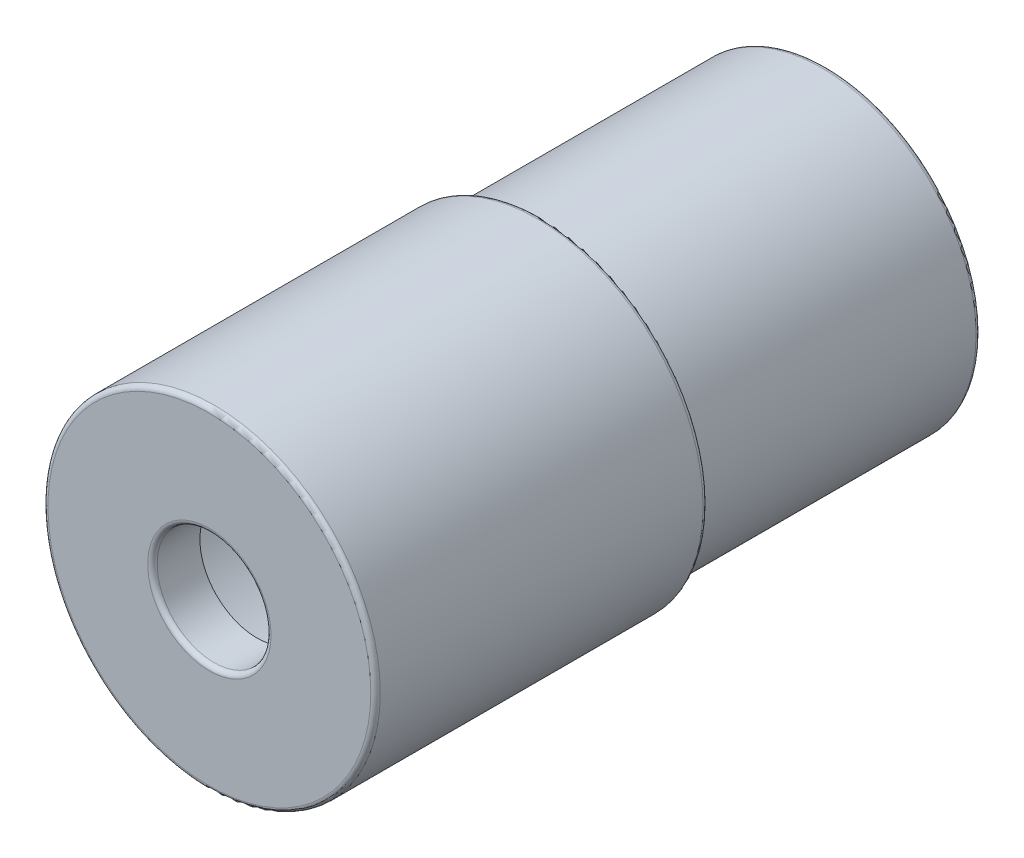
ISO-10303-21;
HEADER;
FILE_DESCRIPTION(('STEP AP214'),'2;1');
FILE_NAME('part.step','',(''),(''),'','','');
FILE_SCHEMA(('AUTOMOTIVE_DESIGN { 1 0 10303 214 1 1 1 1 }'));
ENDSEC;
DATA;
#1=APPLICATION_CONTEXT('core data for automotive mechanical design processes');
#2=APPLICATION_PROTOCOL_DEFINITION('international standard','automotive_design',2000,#1);
#3=PRODUCT_CONTEXT('',#1,'mechanical');
#4=PRODUCT('Part','Part','',(#3));
#5=PRODUCT_RELATED_PRODUCT_CATEGORY('part','',(#4));
#6=PRODUCT_DEFINITION_FORMATION('','',#4);
#7=PRODUCT_DEFINITION_CONTEXT('part definition',#1,'design');
#8=PRODUCT_DEFINITION('design','',#6,#7);
#9=PRODUCT_DEFINITION_SHAPE('','',#8);
#10=(LENGTH_UNIT() NAMED_UNIT(*) SI_UNIT(.MILLI.,.METRE.));
#11=(NAMED_UNIT(*) PLANE_ANGLE_UNIT() SI_UNIT($,.RADIAN.));
#12=(NAMED_UNIT(*) SI_UNIT($,.STERADIAN.) SOLID_ANGLE_UNIT());
#13=UNCERTAINTY_MEASURE_WITH_UNIT(LENGTH_MEASURE(1.E-05),#10,'distance_accuracy_value','');
#14=(GEOMETRIC_REPRESENTATION_CONTEXT(3) GLOBAL_UNCERTAINTY_ASSIGNED_CONTEXT((#13)) GLOBAL_UNIT_ASSIGNED_CONTEXT((#10,
#11,#12)) REPRESENTATION_CONTEXT('',''));
#15=CARTESIAN_POINT('',(0.,0.,0.));
#16=DIRECTION('',(0.,0.,1.));
#17=DIRECTION('',(1.,0.,0.));
#18=AXIS2_PLACEMENT_3D('',#15,#16,#17);
#19=CARTESIAN_POINT('',(0.,0.,-60.));
#20=DIRECTION('',(0.,0.,-1.));
#21=DIRECTION('',(-1.,0.,0.));
#22=AXIS2_PLACEMENT_3D('',#19,#20,#21);
#23=PLANE('',#22);
#24=CARTESIAN_POINT('',(0.,0.,-60.));
#25=DIRECTION('',(0.,0.,-1.));
#26=DIRECTION('',(-1.,0.,0.));
#27=AXIS2_PLACEMENT_3D('',#24,#25,#26);
#28=CIRCLE('',#27,15.5);
#29=CARTESIAN_POINT('',(-15.5,0.,-60.));
#30=VERTEX_POINT('',#29);
#31=EDGE_CURVE('E69',#30,#30,#28,.F.);
#32=ORIENTED_EDGE('',*,*,#31,.T.);
#33=EDGE_LOOP('',(#32));
#34=FACE_BOUND('',#33,.T.);
#35=CARTESIAN_POINT('',(0.,0.,-60.));
#36=DIRECTION('',(0.,0.,-1.));
#37=DIRECTION('',(-1.,0.,0.));
#38=AXIS2_PLACEMENT_3D('',#35,#36,#37);
#39=CIRCLE('',#38,15.75);
#40=CARTESIAN_POINT('',(-15.75,0.,-60.));
#41=VERTEX_POINT('',#40);
#42=EDGE_CURVE('E72',#41,#41,#39,.T.);
#43=ORIENTED_EDGE('',*,*,#42,.T.);
#44=EDGE_LOOP('',(#43));
#45=FACE_BOUND('',#44,.T.);
#46=ADVANCED_FACE('F40',(#34,#45),#23,.T.);
#47=CARTESIAN_POINT('',(0.,0.,-60.));
#48=DIRECTION('',(0.,0.,1.));
#49=DIRECTION('',(1.,0.,0.));
#50=AXIS2_PLACEMENT_3D('',#47,#48,#49);
#51=CYLINDRICAL_SURFACE('',#50,16.25);
#52=CARTESIAN_POINT('',(0.,0.,-59.5));
#53=DIRECTION('',(0.,0.,-1.));
#54=DIRECTION('',(-1.,0.,0.));
#55=AXIS2_PLACEMENT_3D('',#52,#53,#54);
#56=CIRCLE('',#55,16.25);
#57=CARTESIAN_POINT('',(-16.25,0.,-59.5));
#58=VERTEX_POINT('',#57);
#59=EDGE_CURVE('E66',#58,#58,#56,.F.);
#60=ORIENTED_EDGE('',*,*,#59,.T.);
#61=EDGE_LOOP('',(#60));
#62=FACE_BOUND('',#61,.T.);
#63=CARTESIAN_POINT('',(0.,0.,-30.5));
#64=DIRECTION('',(0.,0.,1.));
#65=DIRECTION('',(1.,0.,0.));
#66=AXIS2_PLACEMENT_3D('',#63,#64,#65);
#67=CIRCLE('',#66,16.25);
#68=CARTESIAN_POINT('',(16.25,0.,-30.5));
#69=VERTEX_POINT('',#68);
#70=EDGE_CURVE('E81',#69,#69,#67,.F.);
#71=ORIENTED_EDGE('',*,*,#70,.T.);
#72=EDGE_LOOP('',(#71));
#73=FACE_BOUND('',#72,.T.);
#74=ADVANCED_FACE('F109',(#62,#73),#51,.T.);
#75=CARTESIAN_POINT('',(0.,0.,-60.));
#76=DIRECTION('',(0.,0.,1.));
#77=DIRECTION('',(1.,0.,0.));
#78=AXIS2_PLACEMENT_3D('',#75,#76,#77);
#79=CYLINDRICAL_SURFACE('',#78,15.);
#80=CARTESIAN_POINT('',(0.,0.,-59.5));
#81=DIRECTION('',(0.,0.,-1.));
#82=DIRECTION('',(-1.,0.,0.));
#83=AXIS2_PLACEMENT_3D('',#80,#81,#82);
#84=CIRCLE('',#83,15.);
#85=CARTESIAN_POINT('',(-15.,0.,-59.5));
#86=VERTEX_POINT('',#85);
#87=EDGE_CURVE('E75',#86,#86,#84,.T.);
#88=ORIENTED_EDGE('',*,*,#87,.T.);
#89=EDGE_LOOP('',(#88));
#90=FACE_BOUND('',#89,.T.);
#91=CARTESIAN_POINT('',(0.,0.,0.));
#92=DIRECTION('',(0.,0.,1.));
#93=DIRECTION('',(1.,0.,0.));
#94=AXIS2_PLACEMENT_3D('',#91,#92,#93);
#95=CIRCLE('',#94,15.);
#96=CARTESIAN_POINT('',(15.,0.,0.));
#97=VERTEX_POINT('',#96);
#98=EDGE_CURVE('E84',#97,#97,#95,.T.);
#99=ORIENTED_EDGE('',*,*,#98,.T.);
#100=EDGE_LOOP('',(#99));
#101=FACE_BOUND('',#100,.T.);
#102=ADVANCED_FACE('F115',(#90,#101),#79,.F.);
#103=CARTESIAN_POINT('',(0.,0.,-30.));
#104=DIRECTION('',(0.,0.,1.));
#105=DIRECTION('',(1.,0.,0.));
#106=AXIS2_PLACEMENT_3D('',#103,#104,#105);
#107=CYLINDRICAL_SURFACE('',#106,17.5);
#108=CARTESIAN_POINT('',(0.,0.,4.5));
#109=DIRECTION('',(0.,0.,1.));
#110=DIRECTION('',(1.,0.,0.));
#111=AXIS2_PLACEMENT_3D('',#108,#109,#110);
#112=CIRCLE('',#111,17.5);
#113=CARTESIAN_POINT('',(17.5,0.,4.5));
#114=VERTEX_POINT('',#113);
#115=EDGE_CURVE('E10',#114,#114,#112,.F.);
#116=ORIENTED_EDGE('',*,*,#115,.T.);
#117=EDGE_LOOP('',(#116));
#118=FACE_BOUND('',#117,.T.);
#119=CARTESIAN_POINT('',(0.,0.,-29.5));
#120=DIRECTION('',(0.,0.,1.));
#121=DIRECTION('',(1.,0.,0.));
#122=AXIS2_PLACEMENT_3D('',#119,#120,#121);
#123=CIRCLE('',#122,17.5);
#124=CARTESIAN_POINT('',(17.5,0.,-29.5));
#125=VERTEX_POINT('',#124);
#126=EDGE_CURVE('E63',#125,#125,#123,.T.);
#127=ORIENTED_EDGE('',*,*,#126,.T.);
#128=EDGE_LOOP('',(#127));
#129=FACE_BOUND('',#128,.T.);
#130=ADVANCED_FACE('F166',(#118,#129),#107,.T.);
#131=CARTESIAN_POINT('',(0.,0.,-30.));
#132=DIRECTION('',(0.,0.,1.));
#133=DIRECTION('',(1.,0.,0.));
#134=AXIS2_PLACEMENT_3D('',#131,#132,#133);
#135=PLANE('',#134);
#136=CARTESIAN_POINT('',(0.,0.,-30.));
#137=DIRECTION('',(0.,0.,1.));
#138=DIRECTION('',(1.,0.,0.));
#139=AXIS2_PLACEMENT_3D('',#136,#137,#138);
#140=CIRCLE('',#139,17.);
#141=CARTESIAN_POINT('',(17.,0.,-30.));
#142=VERTEX_POINT('',#141);
#143=EDGE_CURVE('E60',#142,#142,#140,.F.);
#144=ORIENTED_EDGE('',*,*,#143,.T.);
#145=EDGE_LOOP('',(#144));
#146=FACE_BOUND('',#145,.T.);
#147=CARTESIAN_POINT('',(0.,0.,-30.));
#148=DIRECTION('',(0.,0.,1.));
#149=DIRECTION('',(1.,0.,0.));
#150=AXIS2_PLACEMENT_3D('',#147,#148,#149);
#151=CIRCLE('',#150,16.75);
#152=CARTESIAN_POINT('',(16.75,0.,-30.));
#153=VERTEX_POINT('',#152);
#154=EDGE_CURVE('E78',#153,#153,#151,.T.);
#155=ORIENTED_EDGE('',*,*,#154,.T.);
#156=EDGE_LOOP('',(#155));
#157=FACE_BOUND('',#156,.T.);
#158=ADVANCED_FACE('F171',(#146,#157),#135,.F.);
#159=CARTESIAN_POINT('',(0.,0.,0.));
#160=DIRECTION('',(0.,0.,1.));
#161=DIRECTION('',(1.,0.,0.));
#162=AXIS2_PLACEMENT_3D('',#159,#160,#161);
#163=PLANE('',#162);
#164=CARTESIAN_POINT('',(0.,0.,0.));
#165=DIRECTION('',(0.,0.,1.));
#166=DIRECTION('',(1.,0.,0.));
#167=AXIS2_PLACEMENT_3D('',#164,#165,#166);
#168=CIRCLE('',#167,6.);
#169=CARTESIAN_POINT('',(6.,0.,0.));
#170=VERTEX_POINT('',#169);
#171=EDGE_CURVE('E87',#170,#170,#168,.T.);
#172=ORIENTED_EDGE('',*,*,#171,.T.);
#173=EDGE_LOOP('',(#172));
#174=FACE_BOUND('',#173,.T.);
#175=ORIENTED_EDGE('',*,*,#98,.F.);
#176=EDGE_LOOP('',(#175));
#177=FACE_BOUND('',#176,.T.);
#178=ADVANCED_FACE('F91',(#174,#177),#163,.F.);
#179=CARTESIAN_POINT('',(0.,0.,5.));
#180=DIRECTION('',(0.,0.,1.));
#181=DIRECTION('',(1.,0.,0.));
#182=AXIS2_PLACEMENT_3D('',#179,#180,#181);
#183=PLANE('',#182);
#184=CARTESIAN_POINT('',(0.,0.,5.));
#185=DIRECTION('',(0.,0.,1.));
#186=DIRECTION('',(1.,0.,0.));
#187=AXIS2_PLACEMENT_3D('',#184,#185,#186);
#188=CIRCLE('',#187,6.5);
#189=CARTESIAN_POINT('',(6.5,0.,5.));
#190=VERTEX_POINT('',#189);
#191=EDGE_CURVE('E47',#190,#190,#188,.F.);
#192=ORIENTED_EDGE('',*,*,#191,.T.);
#193=EDGE_LOOP('',(#192));
#194=FACE_BOUND('',#193,.T.);
#195=CARTESIAN_POINT('',(0.,0.,5.));
#196=DIRECTION('',(0.,0.,1.));
#197=DIRECTION('',(1.,0.,0.));
#198=AXIS2_PLACEMENT_3D('',#195,#196,#197);
#199=CIRCLE('',#198,17.);
#200=CARTESIAN_POINT('',(17.,0.,5.));
#201=VERTEX_POINT('',#200);
#202=EDGE_CURVE('E51',#201,#201,#199,.T.);
#203=ORIENTED_EDGE('',*,*,#202,.T.);
#204=EDGE_LOOP('',(#203));
#205=FACE_BOUND('',#204,.T.);
#206=ADVANCED_FACE('F97',(#194,#205),#183,.T.);
#207=CARTESIAN_POINT('',(0.,0.,-5.));
#208=DIRECTION('',(0.,0.,1.));
#209=DIRECTION('',(1.,0.,0.));
#210=AXIS2_PLACEMENT_3D('',#207,#208,#209);
#211=CYLINDRICAL_SURFACE('',#210,6.);
#212=CARTESIAN_POINT('',(0.,0.,4.5));
#213=DIRECTION('',(0.,0.,1.));
#214=DIRECTION('',(1.,0.,0.));
#215=AXIS2_PLACEMENT_3D('',#212,#213,#214);
#216=CIRCLE('',#215,6.);
#217=CARTESIAN_POINT('',(6.,0.,4.5));
#218=VERTEX_POINT('',#217);
#219=EDGE_CURVE('E55',#218,#218,#216,.T.);
#220=ORIENTED_EDGE('',*,*,#219,.T.);
#221=EDGE_LOOP('',(#220));
#222=FACE_BOUND('',#221,.T.);
#223=ORIENTED_EDGE('',*,*,#171,.F.);
#224=EDGE_LOOP('',(#223));
#225=FACE_BOUND('',#224,.T.);
#226=ADVANCED_FACE('F94',(#222,#225),#211,.F.);
#227=CARTESIAN_POINT('',(0.,0.,-30.5));
#228=DIRECTION('',(0.,0.,1.));
#229=DIRECTION('',(1.,0.,0.));
#230=AXIS2_PLACEMENT_3D('',#227,#228,#229);
#231=TOROIDAL_SURFACE('',#230,16.75,0.5);
#232=ORIENTED_EDGE('',*,*,#154,.F.);
#233=EDGE_LOOP('',(#232));
#234=FACE_BOUND('',#233,.T.);
#235=ORIENTED_EDGE('',*,*,#70,.F.);
#236=EDGE_LOOP('',(#235));
#237=FACE_BOUND('',#236,.T.);
#238=ADVANCED_FACE('F96',(#234,#237),#231,.F.);
#239=CARTESIAN_POINT('',(0.,0.,-59.5));
#240=DIRECTION('',(0.,0.,-1.));
#241=DIRECTION('',(-1.,0.,0.));
#242=AXIS2_PLACEMENT_3D('',#239,#240,#241);
#243=TOROIDAL_SURFACE('',#242,15.5,0.5);
#244=ORIENTED_EDGE('',*,*,#31,.F.);
#245=EDGE_LOOP('',(#244));
#246=FACE_BOUND('',#245,.T.);
#247=ORIENTED_EDGE('',*,*,#87,.F.);
#248=EDGE_LOOP('',(#247));
#249=FACE_BOUND('',#248,.T.);
#250=ADVANCED_FACE('F104',(#246,#249),#243,.T.);
#251=CARTESIAN_POINT('',(0.,0.,-59.5));
#252=DIRECTION('',(0.,0.,-1.));
#253=DIRECTION('',(-1.,0.,0.));
#254=AXIS2_PLACEMENT_3D('',#251,#252,#253);
#255=TOROIDAL_SURFACE('',#254,15.75,0.5);
#256=ORIENTED_EDGE('',*,*,#59,.F.);
#257=EDGE_LOOP('',(#256));
#258=FACE_BOUND('',#257,.T.);
#259=ORIENTED_EDGE('',*,*,#42,.F.);
#260=EDGE_LOOP('',(#259));
#261=FACE_BOUND('',#260,.T.);
#262=ADVANCED_FACE('F124',(#258,#261),#255,.T.);
#263=CARTESIAN_POINT('',(0.,0.,-29.5));
#264=DIRECTION('',(0.,0.,1.));
#265=DIRECTION('',(1.,0.,0.));
#266=AXIS2_PLACEMENT_3D('',#263,#264,#265);
#267=TOROIDAL_SURFACE('',#266,17.,0.5);
#268=ORIENTED_EDGE('',*,*,#143,.F.);
#269=EDGE_LOOP('',(#268));
#270=FACE_BOUND('',#269,.T.);
#271=ORIENTED_EDGE('',*,*,#126,.F.);
#272=EDGE_LOOP('',(#271));
#273=FACE_BOUND('',#272,.T.);
#274=ADVANCED_FACE('F128',(#270,#273),#267,.T.);
#275=CARTESIAN_POINT('',(0.,0.,4.5));
#276=DIRECTION('',(0.,0.,1.));
#277=DIRECTION('',(1.,0.,0.));
#278=AXIS2_PLACEMENT_3D('',#275,#276,#277);
#279=TOROIDAL_SURFACE('',#278,6.5,0.5);
#280=ORIENTED_EDGE('',*,*,#191,.F.);
#281=EDGE_LOOP('',(#280));
#282=FACE_BOUND('',#281,.T.);
#283=ORIENTED_EDGE('',*,*,#219,.F.);
#284=EDGE_LOOP('',(#283));
#285=FACE_BOUND('',#284,.T.);
#286=ADVANCED_FACE('F131',(#282,#285),#279,.T.);
#287=CARTESIAN_POINT('',(0.,0.,4.5));
#288=DIRECTION('',(0.,0.,1.));
#289=DIRECTION('',(1.,0.,0.));
#290=AXIS2_PLACEMENT_3D('',#287,#288,#289);
#291=TOROIDAL_SURFACE('',#290,17.,0.5);
#292=ORIENTED_EDGE('',*,*,#115,.F.);
#293=EDGE_LOOP('',(#292));
#294=FACE_BOUND('',#293,.T.);
#295=ORIENTED_EDGE('',*,*,#202,.F.);
#296=EDGE_LOOP('',(#295));
#297=FACE_BOUND('',#296,.T.);
#298=ADVANCED_FACE('F42',(#294,#297),#291,.T.);
#299=CLOSED_SHELL('',(#46,#74,#102,#130,#158,#178,#206,#226,#238,#250,#262,#274,#286,#298));
#300=MANIFOLD_SOLID_BREP('B2',#299);
#301=ADVANCED_BREP_SHAPE_REPRESENTATION('',(#18,#300),#14);
#302=SHAPE_DEFINITION_REPRESENTATION(#9,#301);
ENDSEC;
END-ISO-10303-21;
